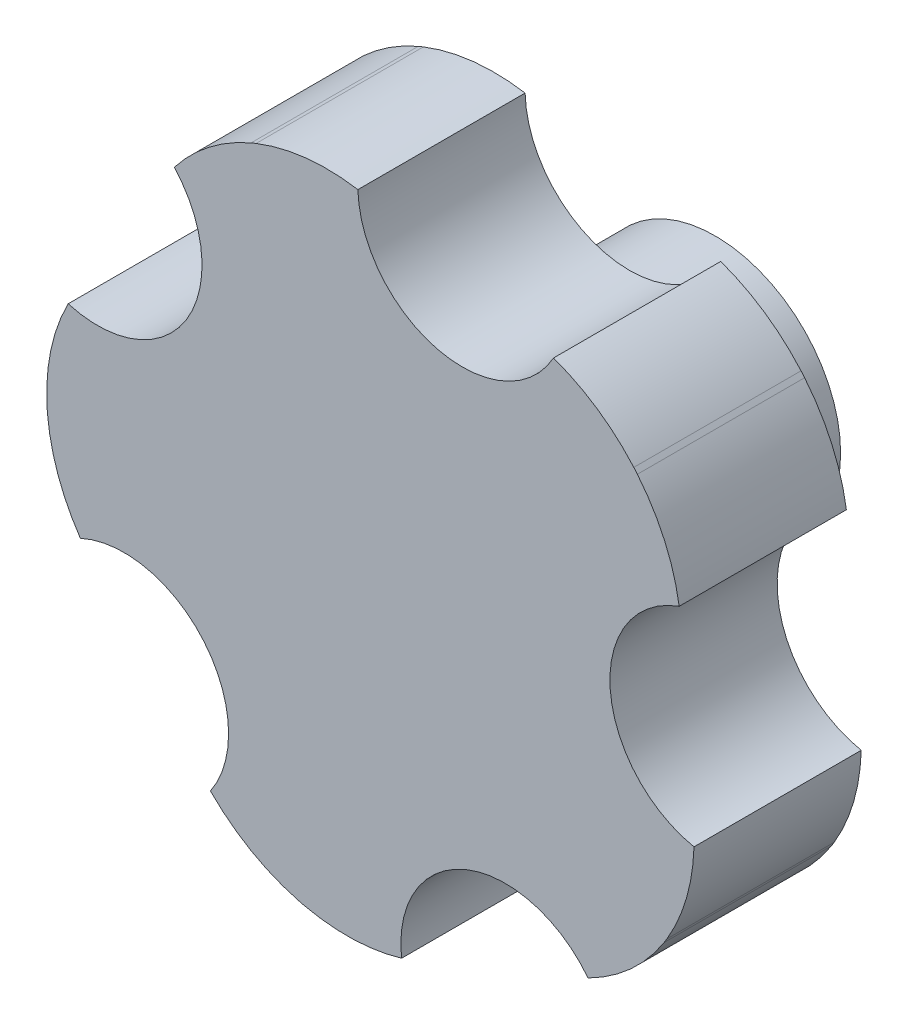
ISO-10303-21;
HEADER;
FILE_DESCRIPTION(('STEP AP214'),'2;1');
FILE_NAME('part.step','',(''),(''),'','','');
FILE_SCHEMA(('AUTOMOTIVE_DESIGN { 1 0 10303 214 1 1 1 1 }'));
ENDSEC;
DATA;
#1=APPLICATION_CONTEXT('core data for automotive mechanical design processes');
#2=APPLICATION_PROTOCOL_DEFINITION('international standard','automotive_design',2000,#1);
#3=PRODUCT_CONTEXT('',#1,'mechanical');
#4=PRODUCT('Part','Part','',(#3));
#5=PRODUCT_RELATED_PRODUCT_CATEGORY('part','',(#4));
#6=PRODUCT_DEFINITION_FORMATION('','',#4);
#7=PRODUCT_DEFINITION_CONTEXT('part definition',#1,'design');
#8=PRODUCT_DEFINITION('design','',#6,#7);
#9=PRODUCT_DEFINITION_SHAPE('','',#8);
#10=(LENGTH_UNIT() NAMED_UNIT(*) SI_UNIT(.MILLI.,.METRE.));
#11=(NAMED_UNIT(*) PLANE_ANGLE_UNIT() SI_UNIT($,.RADIAN.));
#12=(NAMED_UNIT(*) SI_UNIT($,.STERADIAN.) SOLID_ANGLE_UNIT());
#13=UNCERTAINTY_MEASURE_WITH_UNIT(LENGTH_MEASURE(1.E-05),#10,'distance_accuracy_value','');
#14=(GEOMETRIC_REPRESENTATION_CONTEXT(3) GLOBAL_UNCERTAINTY_ASSIGNED_CONTEXT((#13)) GLOBAL_UNIT_ASSIGNED_CONTEXT((#10,
#11,#12)) REPRESENTATION_CONTEXT('',''));
#15=CARTESIAN_POINT('',(0.,0.,0.));
#16=DIRECTION('',(0.,0.,1.));
#17=DIRECTION('',(1.,0.,0.));
#18=AXIS2_PLACEMENT_3D('',#15,#16,#17);
#19=CARTESIAN_POINT('',(0.,0.,19.05));
#20=DIRECTION('',(0.,0.,1.));
#21=DIRECTION('',(1.,0.,0.));
#22=AXIS2_PLACEMENT_3D('',#19,#20,#21);
#23=PLANE('',#22);
#24=CARTESIAN_POINT('',(0.,0.,19.05));
#25=DIRECTION('',(0.,0.,-1.));
#26=DIRECTION('',(-1.,0.,0.));
#27=AXIS2_PLACEMENT_3D('',#24,#25,#26);
#28=CIRCLE('',#27,2.48793);
#29=CARTESIAN_POINT('',(-2.48793,0.,19.05));
#30=VERTEX_POINT('',#29);
#31=EDGE_CURVE('E20',#30,#30,#28,.T.);
#32=ORIENTED_EDGE('',*,*,#31,.T.);
#33=EDGE_LOOP('',(#32));
#34=FACE_BOUND('',#33,.T.);
#35=ADVANCED_FACE('F17',(#34),#23,.F.);
#36=CARTESIAN_POINT('',(0.,0.,0.));
#37=DIRECTION('',(0.,0.,-1.));
#38=DIRECTION('',(-1.,0.,0.));
#39=AXIS2_PLACEMENT_3D('',#36,#37,#38);
#40=CYLINDRICAL_SURFACE('',#39,2.48793);
#41=CARTESIAN_POINT('',(0.,0.,0.));
#42=DIRECTION('',(0.,0.,-1.));
#43=DIRECTION('',(-1.,0.,0.));
#44=AXIS2_PLACEMENT_3D('',#41,#42,#43);
#45=CIRCLE('',#44,2.48793);
#46=CARTESIAN_POINT('',(-2.48793,0.,0.));
#47=VERTEX_POINT('',#46);
#48=EDGE_CURVE('E261',#47,#47,#45,.F.);
#49=ORIENTED_EDGE('',*,*,#48,.F.);
#50=EDGE_LOOP('',(#49));
#51=FACE_BOUND('',#50,.T.);
#52=ORIENTED_EDGE('',*,*,#31,.F.);
#53=EDGE_LOOP('',(#52));
#54=FACE_BOUND('',#53,.T.);
#55=ADVANCED_FACE('F269',(#51,#54),#40,.F.);
#56=CARTESIAN_POINT('',(0.,0.,0.));
#57=DIRECTION('',(0.,0.,-1.));
#58=DIRECTION('',(-1.,0.,0.));
#59=AXIS2_PLACEMENT_3D('',#56,#57,#58);
#60=PLANE('',#59);
#61=CARTESIAN_POINT('',(0.,0.,0.));
#62=DIRECTION('',(0.,0.,1.));
#63=DIRECTION('',(1.,0.,0.));
#64=AXIS2_PLACEMENT_3D('',#61,#62,#63);
#65=CIRCLE('',#64,9.525);
#66=CARTESIAN_POINT('',(9.525,0.,0.));
#67=VERTEX_POINT('',#66);
#68=EDGE_CURVE('E161',#67,#67,#65,.T.);
#69=ORIENTED_EDGE('',*,*,#68,.F.);
#70=EDGE_LOOP('',(#69));
#71=FACE_BOUND('',#70,.T.);
#72=ORIENTED_EDGE('',*,*,#48,.T.);
#73=EDGE_LOOP('',(#72));
#74=FACE_BOUND('',#73,.T.);
#75=ADVANCED_FACE('F271',(#71,#74),#60,.T.);
#76=CARTESIAN_POINT('',(0.,0.,12.7));
#77=DIRECTION('',(0.,0.,1.));
#78=DIRECTION('',(1.,0.,0.));
#79=AXIS2_PLACEMENT_3D('',#76,#77,#78);
#80=CYLINDRICAL_SURFACE('',#79,9.525);
#81=ORIENTED_EDGE('',*,*,#68,.T.);
#82=EDGE_LOOP('',(#81));
#83=FACE_BOUND('',#82,.T.);
#84=CARTESIAN_POINT('',(0.,0.,12.7));
#85=DIRECTION('',(0.,0.,1.));
#86=DIRECTION('',(1.,0.,0.));
#87=AXIS2_PLACEMENT_3D('',#84,#85,#86);
#88=CIRCLE('',#87,9.525);
#89=CARTESIAN_POINT('',(9.525,0.,12.7));
#90=VERTEX_POINT('',#89);
#91=EDGE_CURVE('E240',#90,#90,#88,.T.);
#92=ORIENTED_EDGE('',*,*,#91,.F.);
#93=EDGE_LOOP('',(#92));
#94=FACE_BOUND('',#93,.T.);
#95=ADVANCED_FACE('F278',(#83,#94),#80,.T.);
#96=CARTESIAN_POINT('',(0.,0.,25.4));
#97=DIRECTION('',(0.,0.,1.));
#98=DIRECTION('',(1.,0.,0.));
#99=AXIS2_PLACEMENT_3D('',#96,#97,#98);
#100=CYLINDRICAL_SURFACE('',#99,25.4);
#101=DIRECTION('',(0.,0.,-1.));
#102=VECTOR('',#101,1.);
#103=CARTESIAN_POINT('',(19.2191807686587,16.606718236353,-187.325));
#104=LINE('',#103,#102);
#105=CARTESIAN_POINT('',(19.2191807686599,16.6067182363516,25.4));
#106=VERTEX_POINT('',#105);
#107=CARTESIAN_POINT('',(19.2191807686599,16.6067182363516,12.7));
#108=VERTEX_POINT('',#107);
#109=EDGE_CURVE('E158',#106,#108,#104,.T.);
#110=ORIENTED_EDGE('',*,*,#109,.F.);
#111=CARTESIAN_POINT('',(0.,0.,25.4));
#112=DIRECTION('',(0.,0.,1.));
#113=DIRECTION('',(1.,0.,0.));
#114=AXIS2_PLACEMENT_3D('',#111,#112,#113);
#115=CIRCLE('',#114,25.4);
#116=CARTESIAN_POINT('',(19.4901091035739,16.287898794221,25.4));
#117=VERTEX_POINT('',#116);
#118=EDGE_CURVE('E150',#106,#117,#115,.F.);
#119=ORIENTED_EDGE('',*,*,#118,.T.);
#120=DIRECTION('',(0.,0.,-1.));
#121=VECTOR('',#120,1.);
#122=CARTESIAN_POINT('',(19.490109103575,16.2878987942196,-187.325));
#123=LINE('',#122,#121);
#124=CARTESIAN_POINT('',(19.4901091035739,16.287898794221,12.7));
#125=VERTEX_POINT('',#124);
#126=EDGE_CURVE('E157',#125,#117,#123,.F.);
#127=ORIENTED_EDGE('',*,*,#126,.F.);
#128=CARTESIAN_POINT('',(0.,0.,12.7));
#129=DIRECTION('',(0.,0.,1.));
#130=DIRECTION('',(1.,0.,0.));
#131=AXIS2_PLACEMENT_3D('',#128,#129,#130);
#132=CIRCLE('',#131,25.4);
#133=EDGE_CURVE('E251',#108,#125,#132,.F.);
#134=ORIENTED_EDGE('',*,*,#133,.F.);
#135=EDGE_LOOP('',(#110,#119,#127,#134));
#136=FACE_BOUND('',#135,.T.);
#137=ADVANCED_FACE('F155',(#136),#100,.T.);
#138=CARTESIAN_POINT('',(0.,0.,25.4));
#139=DIRECTION('',(0.,0.,1.));
#140=DIRECTION('',(1.,0.,0.));
#141=AXIS2_PLACEMENT_3D('',#138,#139,#140);
#142=CYLINDRICAL_SURFACE('',#141,25.4);
#143=DIRECTION('',(0.,0.,-1.));
#144=VECTOR('',#143,1.);
#145=CARTESIAN_POINT('',(21.7324162066732,-13.1477026822151,-187.325));
#146=LINE('',#145,#144);
#147=CARTESIAN_POINT('',(21.7324162066722,-13.1477026822168,25.4));
#148=VERTEX_POINT('',#147);
#149=CARTESIAN_POINT('',(21.7324162066722,-13.1477026822168,12.7));
#150=VERTEX_POINT('',#149);
#151=EDGE_CURVE('E233',#148,#150,#146,.T.);
#152=ORIENTED_EDGE('',*,*,#151,.F.);
#153=CARTESIAN_POINT('',(0.,0.,25.4));
#154=DIRECTION('',(0.,0.,1.));
#155=DIRECTION('',(1.,0.,0.));
#156=AXIS2_PLACEMENT_3D('',#153,#154,#155);
#157=CIRCLE('',#156,25.4);
#158=CARTESIAN_POINT('',(21.5129070552592,-13.503882035614,25.4));
#159=VERTEX_POINT('',#158);
#160=EDGE_CURVE('E160',#148,#159,#157,.F.);
#161=ORIENTED_EDGE('',*,*,#160,.T.);
#162=DIRECTION('',(0.,0.,-1.));
#163=VECTOR('',#162,1.);
#164=CARTESIAN_POINT('',(21.512907055258,-13.5038820356158,-187.325));
#165=LINE('',#164,#163);
#166=CARTESIAN_POINT('',(21.5129070552592,-13.503882035614,12.7));
#167=VERTEX_POINT('',#166);
#168=EDGE_CURVE('E229',#167,#159,#165,.F.);
#169=ORIENTED_EDGE('',*,*,#168,.F.);
#170=CARTESIAN_POINT('',(0.,0.,12.7));
#171=DIRECTION('',(0.,0.,1.));
#172=DIRECTION('',(1.,0.,0.));
#173=AXIS2_PLACEMENT_3D('',#170,#171,#172);
#174=CIRCLE('',#173,25.4);
#175=EDGE_CURVE('E249',#150,#167,#174,.F.);
#176=ORIENTED_EDGE('',*,*,#175,.F.);
#177=EDGE_LOOP('',(#152,#161,#169,#176));
#178=FACE_BOUND('',#177,.T.);
#179=ADVANCED_FACE('F358',(#178),#142,.T.);
#180=CARTESIAN_POINT('',(0.,0.,25.4));
#181=DIRECTION('',(0.,0.,1.));
#182=DIRECTION('',(1.,0.,0.));
#183=AXIS2_PLACEMENT_3D('',#180,#181,#182);
#184=CYLINDRICAL_SURFACE('',#183,25.4);
#185=DIRECTION('',(0.,0.,-1.));
#186=VECTOR('',#185,1.);
#187=CARTESIAN_POINT('',(-5.78958494489231,-24.7313708913573,-187.325));
#188=LINE('',#187,#186);
#189=CARTESIAN_POINT('',(-5.78958494489737,-24.7313708913561,25.4));
#190=VERTEX_POINT('',#189);
#191=CARTESIAN_POINT('',(-5.78958494489737,-24.7313708913561,12.7));
#192=VERTEX_POINT('',#191);
#193=EDGE_CURVE('E221',#190,#192,#188,.T.);
#194=ORIENTED_EDGE('',*,*,#193,.F.);
#195=CARTESIAN_POINT('',(0.,0.,25.4));
#196=DIRECTION('',(0.,0.,1.));
#197=DIRECTION('',(1.,0.,0.));
#198=AXIS2_PLACEMENT_3D('',#195,#196,#197);
#199=CIRCLE('',#198,25.4);
#200=CARTESIAN_POINT('',(-6.19615945715802,-24.6326532874855,25.4));
#201=VERTEX_POINT('',#200);
#202=EDGE_CURVE('E257',#190,#201,#199,.F.);
#203=ORIENTED_EDGE('',*,*,#202,.T.);
#204=DIRECTION('',(0.,0.,-1.));
#205=VECTOR('',#204,1.);
#206=CARTESIAN_POINT('',(-6.19615945716304,-24.6326532874842,-187.325));
#207=LINE('',#206,#205);
#208=CARTESIAN_POINT('',(-6.19615945715802,-24.6326532874855,12.7));
#209=VERTEX_POINT('',#208);
#210=EDGE_CURVE('E217',#209,#201,#207,.F.);
#211=ORIENTED_EDGE('',*,*,#210,.F.);
#212=CARTESIAN_POINT('',(0.,0.,12.7));
#213=DIRECTION('',(0.,0.,1.));
#214=DIRECTION('',(1.,0.,0.));
#215=AXIS2_PLACEMENT_3D('',#212,#213,#214);
#216=CIRCLE('',#215,25.4);
#217=EDGE_CURVE('E247',#192,#209,#216,.F.);
#218=ORIENTED_EDGE('',*,*,#217,.F.);
#219=EDGE_LOOP('',(#194,#203,#211,#218));
#220=FACE_BOUND('',#219,.T.);
#221=ADVANCED_FACE('F354',(#220),#184,.T.);
#222=CARTESIAN_POINT('',(0.,0.,25.4));
#223=DIRECTION('',(0.,0.,1.));
#224=DIRECTION('',(1.,0.,0.));
#225=AXIS2_PLACEMENT_3D('',#222,#223,#224);
#226=CYLINDRICAL_SURFACE('',#225,25.4);
#227=DIRECTION('',(0.,0.,-1.));
#228=VECTOR('',#227,1.);
#229=CARTESIAN_POINT('',(-25.3100115814867,-2.1361914111349,-187.325));
#230=LINE('',#229,#228);
#231=CARTESIAN_POINT('',(-25.310011581487,-2.1361914111322,25.4));
#232=VERTEX_POINT('',#231);
#233=CARTESIAN_POINT('',(-25.310011581487,-2.1361914111322,12.7));
#234=VERTEX_POINT('',#233);
#235=EDGE_CURVE('E209',#232,#234,#230,.T.);
#236=ORIENTED_EDGE('',*,*,#235,.F.);
#237=CARTESIAN_POINT('',(0.,0.,25.4));
#238=DIRECTION('',(0.,0.,1.));
#239=DIRECTION('',(1.,0.,0.));
#240=AXIS2_PLACEMENT_3D('',#237,#238,#239);
#241=CIRCLE('',#240,25.4);
#242=CARTESIAN_POINT('',(-25.3417639948213,-1.71901065464281,25.4));
#243=VERTEX_POINT('',#242);
#244=EDGE_CURVE('E255',#232,#243,#241,.F.);
#245=ORIENTED_EDGE('',*,*,#244,.T.);
#246=DIRECTION('',(0.,0.,-1.));
#247=VECTOR('',#246,1.);
#248=CARTESIAN_POINT('',(-25.3417639948215,-1.71901065464009,-187.325));
#249=LINE('',#248,#247);
#250=CARTESIAN_POINT('',(-25.3417639948213,-1.71901065464281,12.7));
#251=VERTEX_POINT('',#250);
#252=EDGE_CURVE('E205',#251,#243,#249,.F.);
#253=ORIENTED_EDGE('',*,*,#252,.F.);
#254=CARTESIAN_POINT('',(0.,0.,12.7));
#255=DIRECTION('',(0.,0.,1.));
#256=DIRECTION('',(1.,0.,0.));
#257=AXIS2_PLACEMENT_3D('',#254,#255,#256);
#258=CIRCLE('',#257,25.4);
#259=EDGE_CURVE('E245',#234,#251,#258,.F.);
#260=ORIENTED_EDGE('',*,*,#259,.F.);
#261=EDGE_LOOP('',(#236,#245,#253,#260));
#262=FACE_BOUND('',#261,.T.);
#263=ADVANCED_FACE('F350',(#262),#226,.T.);
#264=CARTESIAN_POINT('',(0.,0.,25.4));
#265=DIRECTION('',(0.,0.,1.));
#266=DIRECTION('',(1.,0.,0.));
#267=AXIS2_PLACEMENT_3D('',#264,#265,#266);
#268=CYLINDRICAL_SURFACE('',#267,25.4);
#269=DIRECTION('',(0.,0.,-1.));
#270=VECTOR('',#269,1.);
#271=CARTESIAN_POINT('',(-9.85160107787468,23.4116628243792,-187.325));
#272=LINE('',#271,#270);
#273=CARTESIAN_POINT('',(-9.85160107787304,23.4116628243799,25.4));
#274=VERTEX_POINT('',#273);
#275=CARTESIAN_POINT('',(-9.85160107787304,23.4116628243799,12.7));
#276=VERTEX_POINT('',#275);
#277=EDGE_CURVE('E197',#274,#276,#272,.T.);
#278=ORIENTED_EDGE('',*,*,#277,.F.);
#279=CARTESIAN_POINT('',(0.,0.,25.4));
#280=DIRECTION('',(0.,0.,1.));
#281=DIRECTION('',(1.,0.,0.));
#282=AXIS2_PLACEMENT_3D('',#279,#280,#281);
#283=CIRCLE('',#282,25.4);
#284=CARTESIAN_POINT('',(-9.46464206386472,23.5707562586125,25.4));
#285=VERTEX_POINT('',#284);
#286=EDGE_CURVE('E253',#274,#285,#283,.F.);
#287=ORIENTED_EDGE('',*,*,#286,.T.);
#288=DIRECTION('',(0.,0.,-1.));
#289=VECTOR('',#288,1.);
#290=CARTESIAN_POINT('',(-9.46464206386304,23.5707562586132,-187.325));
#291=LINE('',#290,#289);
#292=CARTESIAN_POINT('',(-9.46464206386472,23.5707562586125,12.7));
#293=VERTEX_POINT('',#292);
#294=EDGE_CURVE('E193',#293,#285,#291,.F.);
#295=ORIENTED_EDGE('',*,*,#294,.F.);
#296=CARTESIAN_POINT('',(0.,0.,12.7));
#297=DIRECTION('',(0.,0.,1.));
#298=DIRECTION('',(1.,0.,0.));
#299=AXIS2_PLACEMENT_3D('',#296,#297,#298);
#300=CIRCLE('',#299,25.4);
#301=EDGE_CURVE('E243',#276,#293,#300,.F.);
#302=ORIENTED_EDGE('',*,*,#301,.F.);
#303=EDGE_LOOP('',(#278,#287,#295,#302));
#304=FACE_BOUND('',#303,.T.);
#305=ADVANCED_FACE('F346',(#304),#268,.T.);
#306=CARTESIAN_POINT('',(0.,0.,12.7));
#307=DIRECTION('',(0.,0.,-1.));
#308=DIRECTION('',(-1.,0.,0.));
#309=AXIS2_PLACEMENT_3D('',#306,#307,#308);
#310=PLANE('',#309);
#311=ORIENTED_EDGE('',*,*,#91,.T.);
#312=EDGE_LOOP('',(#311));
#313=FACE_BOUND('',#312,.T.);
#314=CARTESIAN_POINT('',(-4.10465767202104,9.98365704573353,12.7));
#315=DIRECTION('',(0.,0.,-1.));
#316=DIRECTION('',(-1.,0.,0.));
#317=AXIS2_PLACEMENT_3D('',#314,#315,#316);
#318=CIRCLE('',#317,14.6061185022382);
#319=CARTESIAN_POINT('',(-15.6796619178986,18.8919663359043,12.7));
#320=VERTEX_POINT('',#319);
#321=EDGE_CURVE('E194',#276,#320,#318,.F.);
#322=ORIENTED_EDGE('',*,*,#321,.F.);
#323=ORIENTED_EDGE('',*,*,#301,.T.);
#324=CARTESIAN_POINT('',(-4.10465767202104,9.98365704573353,12.7));
#325=DIRECTION('',(0.,0.,-1.));
#326=DIRECTION('',(-1.,0.,0.));
#327=AXIS2_PLACEMENT_3D('',#324,#325,#326);
#328=CIRCLE('',#327,14.6061185022382);
#329=CARTESIAN_POINT('',(-1.73757388036686,24.3966932291584,12.7));
#330=VERTEX_POINT('',#329);
#331=EDGE_CURVE('E190',#330,#293,#328,.F.);
#332=ORIENTED_EDGE('',*,*,#331,.F.);
#333=CARTESIAN_POINT('',(6.19642007188148,24.6325877303378,12.7));
#334=DIRECTION('',(0.,0.,-1.));
#335=DIRECTION('',(-1.,0.,0.));
#336=AXIS2_PLACEMENT_3D('',#333,#334,#335);
#337=CIRCLE('',#336,7.9375);
#338=CARTESIAN_POINT('',(13.120407144253,20.751568628139,12.7));
#339=VERTEX_POINT('',#338);
#340=EDGE_CURVE('E186',#330,#339,#337,.F.);
#341=ORIENTED_EDGE('',*,*,#340,.T.);
#342=CARTESIAN_POINT('',(8.2256359317217,6.99003119664533,12.7));
#343=DIRECTION('',(0.,0.,-1.));
#344=DIRECTION('',(-1.,0.,0.));
#345=AXIS2_PLACEMENT_3D('',#342,#343,#344);
#346=CIRCLE('',#345,14.6061185022382);
#347=EDGE_CURVE('E171',#108,#339,#346,.F.);
#348=ORIENTED_EDGE('',*,*,#347,.F.);
#349=ORIENTED_EDGE('',*,*,#133,.T.);
#350=CARTESIAN_POINT('',(8.2256359317217,6.99003119664533,12.7));
#351=DIRECTION('',(0.,0.,-1.));
#352=DIRECTION('',(-1.,0.,0.));
#353=AXIS2_PLACEMENT_3D('',#350,#351,#352);
#354=CIRCLE('',#353,14.6061185022382);
#355=CARTESIAN_POINT('',(22.6649339413027,9.19125147002472,12.7));
#356=VERTEX_POINT('',#355);
#357=EDGE_CURVE('E170',#356,#125,#354,.F.);
#358=ORIENTED_EDGE('',*,*,#357,.F.);
#359=CARTESIAN_POINT('',(25.3417821806472,1.71874253704122,12.7));
#360=DIRECTION('',(0.,0.,-1.));
#361=DIRECTION('',(-1.,0.,0.));
#362=AXIS2_PLACEMENT_3D('',#359,#360,#361);
#363=CIRCLE('',#362,7.9375);
#364=CARTESIAN_POINT('',(23.7901121848006,-6.06561527038192,12.7));
#365=VERTEX_POINT('',#364);
#366=EDGE_CURVE('E234',#356,#365,#363,.F.);
#367=ORIENTED_EDGE('',*,*,#366,.T.);
#368=CARTESIAN_POINT('',(9.18953269554609,-5.66340104961635,12.7));
#369=DIRECTION('',(0.,0.,-1.));
#370=DIRECTION('',(-1.,0.,0.));
#371=AXIS2_PLACEMENT_3D('',#368,#369,#370);
#372=CIRCLE('',#371,14.6061185022382);
#373=EDGE_CURVE('E230',#150,#365,#372,.F.);
#374=ORIENTED_EDGE('',*,*,#373,.F.);
#375=ORIENTED_EDGE('',*,*,#175,.T.);
#376=CARTESIAN_POINT('',(9.18953269554609,-5.66340104961635,12.7));
#377=DIRECTION('',(0.,0.,-1.));
#378=DIRECTION('',(-1.,0.,0.));
#379=AXIS2_PLACEMENT_3D('',#376,#377,#378);
#380=CIRCLE('',#379,14.6061185022382);
#381=CARTESIAN_POINT('',(15.7434893000048,-18.7165367084647,12.7));
#382=VERTEX_POINT('',#381);
#383=EDGE_CURVE('E226',#382,#167,#380,.F.);
#384=ORIENTED_EDGE('',*,*,#383,.F.);
#385=CARTESIAN_POINT('',(9.4636372494995,-23.5711597086331,12.7));
#386=DIRECTION('',(0.,0.,-1.));
#387=DIRECTION('',(-1.,0.,0.));
#388=AXIS2_PLACEMENT_3D('',#385,#386,#387);
#389=CIRCLE('',#388,7.9375);
#390=CARTESIAN_POINT('',(1.58072836187907,-24.5004894237906,12.7));
#391=VERTEX_POINT('',#390);
#392=EDGE_CURVE('E222',#382,#391,#389,.F.);
#393=ORIENTED_EDGE('',*,*,#392,.T.);
#394=CARTESIAN_POINT('',(-2.54694338613268,-10.4897427041439,12.7));
#395=DIRECTION('',(0.,0.,-1.));
#396=DIRECTION('',(-1.,0.,0.));
#397=AXIS2_PLACEMENT_3D('',#394,#395,#396);
#398=CIRCLE('',#397,14.6061185022382);
#399=EDGE_CURVE('E218',#192,#391,#398,.F.);
#400=ORIENTED_EDGE('',*,*,#399,.F.);
#401=ORIENTED_EDGE('',*,*,#217,.T.);
#402=CARTESIAN_POINT('',(-2.54694338613268,-10.4897427041439,12.7));
#403=DIRECTION('',(0.,0.,-1.));
#404=DIRECTION('',(-1.,0.,0.));
#405=AXIS2_PLACEMENT_3D('',#402,#403,#404);
#406=CIRCLE('',#405,14.6061185022382);
#407=CARTESIAN_POINT('',(-12.9356183281433,-20.7568810907961,12.7));
#408=VERTEX_POINT('',#407);
#409=EDGE_CURVE('E214',#408,#209,#406,.F.);
#410=ORIENTED_EDGE('',*,*,#409,.F.);
#411=CARTESIAN_POINT('',(-19.4930802988341,-16.2843428010837,12.7));
#412=DIRECTION('',(0.,0.,-1.));
#413=DIRECTION('',(-1.,0.,0.));
#414=AXIS2_PLACEMENT_3D('',#411,#412,#413);
#415=CIRCLE('',#414,7.9375);
#416=CARTESIAN_POINT('',(-22.8128781916055,-9.07442961151263,12.7));
#417=VERTEX_POINT('',#416);
#418=EDGE_CURVE('E210',#408,#417,#415,.F.);
#419=ORIENTED_EDGE('',*,*,#418,.T.);
#420=CARTESIAN_POINT('',(-10.7633869430615,-0.819221658184775,12.7));
#421=DIRECTION('',(0.,0.,-1.));
#422=DIRECTION('',(-1.,0.,0.));
#423=AXIS2_PLACEMENT_3D('',#420,#421,#422);
#424=CIRCLE('',#423,14.6061185022382);
#425=EDGE_CURVE('E206',#234,#417,#424,.F.);
#426=ORIENTED_EDGE('',*,*,#425,.F.);
#427=ORIENTED_EDGE('',*,*,#259,.T.);
#428=CARTESIAN_POINT('',(-10.7633869430615,-0.819221658184775,12.7));
#429=DIRECTION('',(0.,0.,-1.));
#430=DIRECTION('',(-1.,0.,0.));
#431=AXIS2_PLACEMENT_3D('',#428,#429,#430);
#432=CIRCLE('',#431,14.6061185022382);
#433=CARTESIAN_POINT('',(-23.7382929155096,5.88827509601165,12.7));
#434=VERTEX_POINT('',#433);
#435=EDGE_CURVE('E202',#434,#251,#432,.F.);
#436=ORIENTED_EDGE('',*,*,#435,.F.);
#437=CARTESIAN_POINT('',(-21.5110234196099,13.5068823731086,12.7));
#438=DIRECTION('',(0.,0.,-1.));
#439=DIRECTION('',(-1.,0.,0.));
#440=AXIS2_PLACEMENT_3D('',#437,#438,#439);
#441=CIRCLE('',#440,7.9375);
#442=EDGE_CURVE('E198',#434,#320,#441,.F.);
#443=ORIENTED_EDGE('',*,*,#442,.T.);
#444=EDGE_LOOP('',(#322,#323,#332,#341,#348,#349,#358,#367,#374,#375,#384,#393,#400,#401,#410,
#419,#426,#427,#436,#443));
#445=FACE_BOUND('',#444,.T.);
#446=ADVANCED_FACE('F342',(#313,#445),#310,.T.);
#447=CARTESIAN_POINT('',(8.2256359317217,6.99003119664533,-187.325));
#448=DIRECTION('',(0.,0.,-1.));
#449=DIRECTION('',(-1.,0.,0.));
#450=AXIS2_PLACEMENT_3D('',#447,#448,#449);
#451=CYLINDRICAL_SURFACE('',#450,14.6061185022382);
#452=DIRECTION('',(0.,0.,-1.));
#453=VECTOR('',#452,1.);
#454=CARTESIAN_POINT('',(13.120407144253,20.751568628139,-12.7));
#455=LINE('',#454,#453);
#456=CARTESIAN_POINT('',(13.120407144253,20.751568628139,25.4));
#457=VERTEX_POINT('',#456);
#458=EDGE_CURVE('E189',#339,#457,#455,.F.);
#459=ORIENTED_EDGE('',*,*,#458,.T.);
#460=CARTESIAN_POINT('',(8.2256359317217,6.99003119664533,25.4));
#461=DIRECTION('',(0.,0.,-1.));
#462=DIRECTION('',(-1.,0.,0.));
#463=AXIS2_PLACEMENT_3D('',#460,#461,#462);
#464=CIRCLE('',#463,14.6061185022382);
#465=EDGE_CURVE('E179',#457,#106,#464,.T.);
#466=ORIENTED_EDGE('',*,*,#465,.T.);
#467=ORIENTED_EDGE('',*,*,#109,.T.);
#468=ORIENTED_EDGE('',*,*,#347,.T.);
#469=EDGE_LOOP('',(#459,#466,#467,#468));
#470=FACE_BOUND('',#469,.T.);
#471=ADVANCED_FACE('F339',(#470),#451,.T.);
#472=CARTESIAN_POINT('',(8.2256359317217,6.99003119664533,-187.325));
#473=DIRECTION('',(0.,0.,-1.));
#474=DIRECTION('',(-1.,0.,0.));
#475=AXIS2_PLACEMENT_3D('',#472,#473,#474);
#476=CYLINDRICAL_SURFACE('',#475,14.6061185022382);
#477=DIRECTION('',(0.,0.,-1.));
#478=VECTOR('',#477,1.);
#479=CARTESIAN_POINT('',(22.6649339413027,9.19125147002472,-12.7));
#480=LINE('',#479,#478);
#481=CARTESIAN_POINT('',(22.6649339413027,9.19125147002472,25.4));
#482=VERTEX_POINT('',#481);
#483=EDGE_CURVE('E237',#482,#356,#480,.T.);
#484=ORIENTED_EDGE('',*,*,#483,.T.);
#485=ORIENTED_EDGE('',*,*,#357,.T.);
#486=ORIENTED_EDGE('',*,*,#126,.T.);
#487=CARTESIAN_POINT('',(8.2256359317217,6.99003119664533,25.4));
#488=DIRECTION('',(0.,0.,-1.));
#489=DIRECTION('',(-1.,0.,0.));
#490=AXIS2_PLACEMENT_3D('',#487,#488,#489);
#491=CIRCLE('',#490,14.6061185022382);
#492=EDGE_CURVE('E168',#117,#482,#491,.T.);
#493=ORIENTED_EDGE('',*,*,#492,.T.);
#494=EDGE_LOOP('',(#484,#485,#486,#493));
#495=FACE_BOUND('',#494,.T.);
#496=ADVANCED_FACE('F167',(#495),#476,.T.);
#497=CARTESIAN_POINT('',(25.3417821806472,1.71874253704122,-12.7));
#498=DIRECTION('',(0.,0.,-1.));
#499=DIRECTION('',(-1.,0.,0.));
#500=AXIS2_PLACEMENT_3D('',#497,#498,#499);
#501=CYLINDRICAL_SURFACE('',#500,7.9375);
#502=CARTESIAN_POINT('',(25.3417821806472,1.71874253704122,25.4));
#503=DIRECTION('',(0.,0.,-1.));
#504=DIRECTION('',(-1.,0.,0.));
#505=AXIS2_PLACEMENT_3D('',#502,#503,#504);
#506=CIRCLE('',#505,7.9375);
#507=CARTESIAN_POINT('',(23.7901121848006,-6.06561527038192,25.4));
#508=VERTEX_POINT('',#507);
#509=EDGE_CURVE('E178',#482,#508,#506,.F.);
#510=ORIENTED_EDGE('',*,*,#509,.T.);
#511=DIRECTION('',(0.,0.,-1.));
#512=VECTOR('',#511,1.);
#513=CARTESIAN_POINT('',(23.7901121848006,-6.06561527038193,-187.325));
#514=LINE('',#513,#512);
#515=EDGE_CURVE('E232',#365,#508,#514,.F.);
#516=ORIENTED_EDGE('',*,*,#515,.F.);
#517=ORIENTED_EDGE('',*,*,#366,.F.);
#518=ORIENTED_EDGE('',*,*,#483,.F.);
#519=EDGE_LOOP('',(#510,#516,#517,#518));
#520=FACE_BOUND('',#519,.T.);
#521=ADVANCED_FACE('F332',(#520),#501,.F.);
#522=CARTESIAN_POINT('',(9.18953269554609,-5.66340104961635,-187.325));
#523=DIRECTION('',(0.,0.,-1.));
#524=DIRECTION('',(-1.,0.,0.));
#525=AXIS2_PLACEMENT_3D('',#522,#523,#524);
#526=CYLINDRICAL_SURFACE('',#525,14.6061185022382);
#527=ORIENTED_EDGE('',*,*,#515,.T.);
#528=CARTESIAN_POINT('',(9.18953269554609,-5.66340104961635,25.4));
#529=DIRECTION('',(0.,0.,-1.));
#530=DIRECTION('',(-1.,0.,0.));
#531=AXIS2_PLACEMENT_3D('',#528,#529,#530);
#532=CIRCLE('',#531,14.6061185022382);
#533=EDGE_CURVE('E181',#508,#148,#532,.T.);
#534=ORIENTED_EDGE('',*,*,#533,.T.);
#535=ORIENTED_EDGE('',*,*,#151,.T.);
#536=ORIENTED_EDGE('',*,*,#373,.T.);
#537=EDGE_LOOP('',(#527,#534,#535,#536));
#538=FACE_BOUND('',#537,.T.);
#539=ADVANCED_FACE('F328',(#538),#526,.T.);
#540=CARTESIAN_POINT('',(9.18953269554609,-5.66340104961635,-187.325));
#541=DIRECTION('',(0.,0.,-1.));
#542=DIRECTION('',(-1.,0.,0.));
#543=AXIS2_PLACEMENT_3D('',#540,#541,#542);
#544=CYLINDRICAL_SURFACE('',#543,14.6061185022382);
#545=DIRECTION('',(0.,0.,-1.));
#546=VECTOR('',#545,1.);
#547=CARTESIAN_POINT('',(15.7434893000049,-18.7165367084647,-12.7));
#548=LINE('',#547,#546);
#549=CARTESIAN_POINT('',(15.7434893000048,-18.7165367084647,25.4));
#550=VERTEX_POINT('',#549);
#551=EDGE_CURVE('E225',#550,#382,#548,.T.);
#552=ORIENTED_EDGE('',*,*,#551,.T.);
#553=ORIENTED_EDGE('',*,*,#383,.T.);
#554=ORIENTED_EDGE('',*,*,#168,.T.);
#555=CARTESIAN_POINT('',(9.18953269554609,-5.66340104961635,25.4));
#556=DIRECTION('',(0.,0.,-1.));
#557=DIRECTION('',(-1.,0.,0.));
#558=AXIS2_PLACEMENT_3D('',#555,#556,#557);
#559=CIRCLE('',#558,14.6061185022382);
#560=EDGE_CURVE('E434',#159,#550,#559,.T.);
#561=ORIENTED_EDGE('',*,*,#560,.T.);
#562=EDGE_LOOP('',(#552,#553,#554,#561));
#563=FACE_BOUND('',#562,.T.);
#564=ADVANCED_FACE('F324',(#563),#544,.T.);
#565=CARTESIAN_POINT('',(9.4636372494995,-23.5711597086331,-12.7));
#566=DIRECTION('',(0.,0.,-1.));
#567=DIRECTION('',(-1.,0.,0.));
#568=AXIS2_PLACEMENT_3D('',#565,#566,#567);
#569=CYLINDRICAL_SURFACE('',#568,7.9375);
#570=CARTESIAN_POINT('',(9.4636372494995,-23.5711597086331,25.4));
#571=DIRECTION('',(0.,0.,-1.));
#572=DIRECTION('',(-1.,0.,0.));
#573=AXIS2_PLACEMENT_3D('',#570,#571,#572);
#574=CIRCLE('',#573,7.9375);
#575=CARTESIAN_POINT('',(1.58072836187907,-24.5004894237906,25.4));
#576=VERTEX_POINT('',#575);
#577=EDGE_CURVE('E431',#550,#576,#574,.F.);
#578=ORIENTED_EDGE('',*,*,#577,.T.);
#579=DIRECTION('',(0.,0.,-1.));
#580=VECTOR('',#579,1.);
#581=CARTESIAN_POINT('',(1.58072836187908,-24.5004894237906,-187.325));
#582=LINE('',#581,#580);
#583=EDGE_CURVE('E220',#391,#576,#582,.F.);
#584=ORIENTED_EDGE('',*,*,#583,.F.);
#585=ORIENTED_EDGE('',*,*,#392,.F.);
#586=ORIENTED_EDGE('',*,*,#551,.F.);
#587=EDGE_LOOP('',(#578,#584,#585,#586));
#588=FACE_BOUND('',#587,.T.);
#589=ADVANCED_FACE('F320',(#588),#569,.F.);
#590=CARTESIAN_POINT('',(-2.54694338613268,-10.4897427041439,-187.325));
#591=DIRECTION('',(0.,0.,-1.));
#592=DIRECTION('',(-1.,0.,0.));
#593=AXIS2_PLACEMENT_3D('',#590,#591,#592);
#594=CYLINDRICAL_SURFACE('',#593,14.6061185022382);
#595=ORIENTED_EDGE('',*,*,#583,.T.);
#596=CARTESIAN_POINT('',(-2.54694338613268,-10.4897427041439,25.4));
#597=DIRECTION('',(0.,0.,-1.));
#598=DIRECTION('',(-1.,0.,0.));
#599=AXIS2_PLACEMENT_3D('',#596,#597,#598);
#600=CIRCLE('',#599,14.6061185022382);
#601=EDGE_CURVE('E428',#576,#190,#600,.T.);
#602=ORIENTED_EDGE('',*,*,#601,.T.);
#603=ORIENTED_EDGE('',*,*,#193,.T.);
#604=ORIENTED_EDGE('',*,*,#399,.T.);
#605=EDGE_LOOP('',(#595,#602,#603,#604));
#606=FACE_BOUND('',#605,.T.);
#607=ADVANCED_FACE('F316',(#606),#594,.T.);
#608=CARTESIAN_POINT('',(-2.54694338613268,-10.4897427041439,-187.325));
#609=DIRECTION('',(0.,0.,-1.));
#610=DIRECTION('',(-1.,0.,0.));
#611=AXIS2_PLACEMENT_3D('',#608,#609,#610);
#612=CYLINDRICAL_SURFACE('',#611,14.6061185022382);
#613=DIRECTION('',(0.,0.,-1.));
#614=VECTOR('',#613,1.);
#615=CARTESIAN_POINT('',(-12.9356183281433,-20.7568810907961,-12.7));
#616=LINE('',#615,#614);
#617=CARTESIAN_POINT('',(-12.9356183281433,-20.7568810907961,25.4));
#618=VERTEX_POINT('',#617);
#619=EDGE_CURVE('E213',#618,#408,#616,.T.);
#620=ORIENTED_EDGE('',*,*,#619,.T.);
#621=ORIENTED_EDGE('',*,*,#409,.T.);
#622=ORIENTED_EDGE('',*,*,#210,.T.);
#623=CARTESIAN_POINT('',(-2.54694338613268,-10.4897427041439,25.4));
#624=DIRECTION('',(0.,0.,-1.));
#625=DIRECTION('',(-1.,0.,0.));
#626=AXIS2_PLACEMENT_3D('',#623,#624,#625);
#627=CIRCLE('',#626,14.6061185022382);
#628=EDGE_CURVE('E425',#201,#618,#627,.T.);
#629=ORIENTED_EDGE('',*,*,#628,.T.);
#630=EDGE_LOOP('',(#620,#621,#622,#629));
#631=FACE_BOUND('',#630,.T.);
#632=ADVANCED_FACE('F312',(#631),#612,.T.);
#633=CARTESIAN_POINT('',(-19.4930802988341,-16.2843428010837,-12.7));
#634=DIRECTION('',(0.,0.,-1.));
#635=DIRECTION('',(-1.,0.,0.));
#636=AXIS2_PLACEMENT_3D('',#633,#634,#635);
#637=CYLINDRICAL_SURFACE('',#636,7.9375);
#638=CARTESIAN_POINT('',(-19.4930802988341,-16.2843428010837,25.4));
#639=DIRECTION('',(0.,0.,-1.));
#640=DIRECTION('',(-1.,0.,0.));
#641=AXIS2_PLACEMENT_3D('',#638,#639,#640);
#642=CIRCLE('',#641,7.9375);
#643=CARTESIAN_POINT('',(-22.8128781916055,-9.07442961151263,25.4));
#644=VERTEX_POINT('',#643);
#645=EDGE_CURVE('E422',#618,#644,#642,.F.);
#646=ORIENTED_EDGE('',*,*,#645,.T.);
#647=DIRECTION('',(0.,0.,-1.));
#648=VECTOR('',#647,1.);
#649=CARTESIAN_POINT('',(-22.8128781916055,-9.07442961151262,-187.325));
#650=LINE('',#649,#648);
#651=EDGE_CURVE('E208',#417,#644,#650,.F.);
#652=ORIENTED_EDGE('',*,*,#651,.F.);
#653=ORIENTED_EDGE('',*,*,#418,.F.);
#654=ORIENTED_EDGE('',*,*,#619,.F.);
#655=EDGE_LOOP('',(#646,#652,#653,#654));
#656=FACE_BOUND('',#655,.T.);
#657=ADVANCED_FACE('F308',(#656),#637,.F.);
#658=CARTESIAN_POINT('',(-10.7633869430615,-0.819221658184775,-187.325));
#659=DIRECTION('',(0.,0.,-1.));
#660=DIRECTION('',(-1.,0.,0.));
#661=AXIS2_PLACEMENT_3D('',#658,#659,#660);
#662=CYLINDRICAL_SURFACE('',#661,14.6061185022382);
#663=ORIENTED_EDGE('',*,*,#651,.T.);
#664=CARTESIAN_POINT('',(-10.7633869430615,-0.819221658184775,25.4));
#665=DIRECTION('',(0.,0.,-1.));
#666=DIRECTION('',(-1.,0.,0.));
#667=AXIS2_PLACEMENT_3D('',#664,#665,#666);
#668=CIRCLE('',#667,14.6061185022382);
#669=EDGE_CURVE('E419',#644,#232,#668,.T.);
#670=ORIENTED_EDGE('',*,*,#669,.T.);
#671=ORIENTED_EDGE('',*,*,#235,.T.);
#672=ORIENTED_EDGE('',*,*,#425,.T.);
#673=EDGE_LOOP('',(#663,#670,#671,#672));
#674=FACE_BOUND('',#673,.T.);
#675=ADVANCED_FACE('F304',(#674),#662,.T.);
#676=CARTESIAN_POINT('',(-10.7633869430615,-0.819221658184775,-187.325));
#677=DIRECTION('',(0.,0.,-1.));
#678=DIRECTION('',(-1.,0.,0.));
#679=AXIS2_PLACEMENT_3D('',#676,#677,#678);
#680=CYLINDRICAL_SURFACE('',#679,14.6061185022382);
#681=DIRECTION('',(0.,0.,-1.));
#682=VECTOR('',#681,1.);
#683=CARTESIAN_POINT('',(-23.7382929155096,5.88827509601165,-12.7));
#684=LINE('',#683,#682);
#685=CARTESIAN_POINT('',(-23.7382929155096,5.88827509601165,25.4));
#686=VERTEX_POINT('',#685);
#687=EDGE_CURVE('E201',#686,#434,#684,.T.);
#688=ORIENTED_EDGE('',*,*,#687,.T.);
#689=ORIENTED_EDGE('',*,*,#435,.T.);
#690=ORIENTED_EDGE('',*,*,#252,.T.);
#691=CARTESIAN_POINT('',(-10.7633869430615,-0.819221658184775,25.4));
#692=DIRECTION('',(0.,0.,-1.));
#693=DIRECTION('',(-1.,0.,0.));
#694=AXIS2_PLACEMENT_3D('',#691,#692,#693);
#695=CIRCLE('',#694,14.6061185022382);
#696=EDGE_CURVE('E416',#243,#686,#695,.T.);
#697=ORIENTED_EDGE('',*,*,#696,.T.);
#698=EDGE_LOOP('',(#688,#689,#690,#697));
#699=FACE_BOUND('',#698,.T.);
#700=ADVANCED_FACE('F300',(#699),#680,.T.);
#701=CARTESIAN_POINT('',(-21.5110234196099,13.5068823731086,-12.7));
#702=DIRECTION('',(0.,0.,-1.));
#703=DIRECTION('',(-1.,0.,0.));
#704=AXIS2_PLACEMENT_3D('',#701,#702,#703);
#705=CYLINDRICAL_SURFACE('',#704,7.9375);
#706=ORIENTED_EDGE('',*,*,#442,.F.);
#707=ORIENTED_EDGE('',*,*,#687,.F.);
#708=CARTESIAN_POINT('',(-21.5110234196099,13.5068823731086,25.4));
#709=DIRECTION('',(0.,0.,-1.));
#710=DIRECTION('',(-1.,0.,0.));
#711=AXIS2_PLACEMENT_3D('',#708,#709,#710);
#712=CIRCLE('',#711,7.9375);
#713=CARTESIAN_POINT('',(-15.6796619178986,18.8919663359043,25.4));
#714=VERTEX_POINT('',#713);
#715=EDGE_CURVE('E413',#686,#714,#712,.F.);
#716=ORIENTED_EDGE('',*,*,#715,.T.);
#717=DIRECTION('',(0.,0.,-1.));
#718=VECTOR('',#717,1.);
#719=CARTESIAN_POINT('',(-15.6796619178986,18.8919663359043,-187.325));
#720=LINE('',#719,#718);
#721=EDGE_CURVE('E196',#320,#714,#720,.F.);
#722=ORIENTED_EDGE('',*,*,#721,.F.);
#723=EDGE_LOOP('',(#706,#707,#716,#722));
#724=FACE_BOUND('',#723,.T.);
#725=ADVANCED_FACE('F296',(#724),#705,.F.);
#726=CARTESIAN_POINT('',(-4.10465767202104,9.98365704573353,-187.325));
#727=DIRECTION('',(0.,0.,-1.));
#728=DIRECTION('',(-1.,0.,0.));
#729=AXIS2_PLACEMENT_3D('',#726,#727,#728);
#730=CYLINDRICAL_SURFACE('',#729,14.6061185022382);
#731=ORIENTED_EDGE('',*,*,#721,.T.);
#732=CARTESIAN_POINT('',(-4.10465767202104,9.98365704573353,25.4));
#733=DIRECTION('',(0.,0.,-1.));
#734=DIRECTION('',(-1.,0.,0.));
#735=AXIS2_PLACEMENT_3D('',#732,#733,#734);
#736=CIRCLE('',#735,14.6061185022382);
#737=EDGE_CURVE('E381',#714,#274,#736,.T.);
#738=ORIENTED_EDGE('',*,*,#737,.T.);
#739=ORIENTED_EDGE('',*,*,#277,.T.);
#740=ORIENTED_EDGE('',*,*,#321,.T.);
#741=EDGE_LOOP('',(#731,#738,#739,#740));
#742=FACE_BOUND('',#741,.T.);
#743=ADVANCED_FACE('F292',(#742),#730,.T.);
#744=CARTESIAN_POINT('',(-4.10465767202104,9.98365704573353,-187.325));
#745=DIRECTION('',(0.,0.,-1.));
#746=DIRECTION('',(-1.,0.,0.));
#747=AXIS2_PLACEMENT_3D('',#744,#745,#746);
#748=CYLINDRICAL_SURFACE('',#747,14.6061185022382);
#749=DIRECTION('',(0.,0.,-1.));
#750=VECTOR('',#749,1.);
#751=CARTESIAN_POINT('',(-1.73757388036686,24.3966932291584,-12.7));
#752=LINE('',#751,#750);
#753=CARTESIAN_POINT('',(-1.73757388036686,24.3966932291584,25.4));
#754=VERTEX_POINT('',#753);
#755=EDGE_CURVE('E34',#754,#330,#752,.T.);
#756=ORIENTED_EDGE('',*,*,#755,.T.);
#757=ORIENTED_EDGE('',*,*,#331,.T.);
#758=ORIENTED_EDGE('',*,*,#294,.T.);
#759=CARTESIAN_POINT('',(-4.10465767202104,9.98365704573353,25.4));
#760=DIRECTION('',(0.,0.,-1.));
#761=DIRECTION('',(-1.,0.,0.));
#762=AXIS2_PLACEMENT_3D('',#759,#760,#761);
#763=CIRCLE('',#762,14.6061185022382);
#764=EDGE_CURVE('E26',#285,#754,#763,.T.);
#765=ORIENTED_EDGE('',*,*,#764,.T.);
#766=EDGE_LOOP('',(#756,#757,#758,#765));
#767=FACE_BOUND('',#766,.T.);
#768=ADVANCED_FACE('F287',(#767),#748,.T.);
#769=CARTESIAN_POINT('',(6.19642007188148,24.6325877303378,-12.7));
#770=DIRECTION('',(0.,0.,-1.));
#771=DIRECTION('',(-1.,0.,0.));
#772=AXIS2_PLACEMENT_3D('',#769,#770,#771);
#773=CYLINDRICAL_SURFACE('',#772,7.9375);
#774=CARTESIAN_POINT('',(6.19642007188148,24.6325877303378,25.4));
#775=DIRECTION('',(0.,0.,-1.));
#776=DIRECTION('',(-1.,0.,0.));
#777=AXIS2_PLACEMENT_3D('',#774,#775,#776);
#778=CIRCLE('',#777,7.9375);
#779=EDGE_CURVE('E11',#754,#457,#778,.F.);
#780=ORIENTED_EDGE('',*,*,#779,.T.);
#781=ORIENTED_EDGE('',*,*,#458,.F.);
#782=ORIENTED_EDGE('',*,*,#340,.F.);
#783=ORIENTED_EDGE('',*,*,#755,.F.);
#784=EDGE_LOOP('',(#780,#781,#782,#783));
#785=FACE_BOUND('',#784,.T.);
#786=ADVANCED_FACE('F282',(#785),#773,.F.);
#787=CARTESIAN_POINT('',(0.,0.,25.4));
#788=DIRECTION('',(0.,0.,-1.));
#789=DIRECTION('',(-1.,0.,0.));
#790=AXIS2_PLACEMENT_3D('',#787,#788,#789);
#791=PLANE('',#790);
#792=ORIENTED_EDGE('',*,*,#764,.F.);
#793=ORIENTED_EDGE('',*,*,#286,.F.);
#794=ORIENTED_EDGE('',*,*,#737,.F.);
#795=ORIENTED_EDGE('',*,*,#715,.F.);
#796=ORIENTED_EDGE('',*,*,#696,.F.);
#797=ORIENTED_EDGE('',*,*,#244,.F.);
#798=ORIENTED_EDGE('',*,*,#669,.F.);
#799=ORIENTED_EDGE('',*,*,#645,.F.);
#800=ORIENTED_EDGE('',*,*,#628,.F.);
#801=ORIENTED_EDGE('',*,*,#202,.F.);
#802=ORIENTED_EDGE('',*,*,#601,.F.);
#803=ORIENTED_EDGE('',*,*,#577,.F.);
#804=ORIENTED_EDGE('',*,*,#560,.F.);
#805=ORIENTED_EDGE('',*,*,#160,.F.);
#806=ORIENTED_EDGE('',*,*,#533,.F.);
#807=ORIENTED_EDGE('',*,*,#509,.F.);
#808=ORIENTED_EDGE('',*,*,#492,.F.);
#809=ORIENTED_EDGE('',*,*,#118,.F.);
#810=ORIENTED_EDGE('',*,*,#465,.F.);
#811=ORIENTED_EDGE('',*,*,#779,.F.);
#812=EDGE_LOOP('',(#792,#793,#794,#795,#796,#797,#798,#799,#800,#801,#802,#803,#804,#805,#806,
#807,#808,#809,#810,#811));
#813=FACE_BOUND('',#812,.T.);
#814=ADVANCED_FACE('F175',(#813),#791,.F.);
#815=CLOSED_SHELL('',(#35,#55,#75,#95,#137,#179,#221,#263,#305,#446,#471,#496,#521,#539,#564,
#589,#607,#632,#657,#675,#700,#725,#743,#768,#786,#814));
#816=MANIFOLD_SOLID_BREP('B1',#815);
#817=ADVANCED_BREP_SHAPE_REPRESENTATION('',(#18,#816),#14);
#818=SHAPE_DEFINITION_REPRESENTATION(#9,#817);
ENDSEC;
END-ISO-10303-21;
